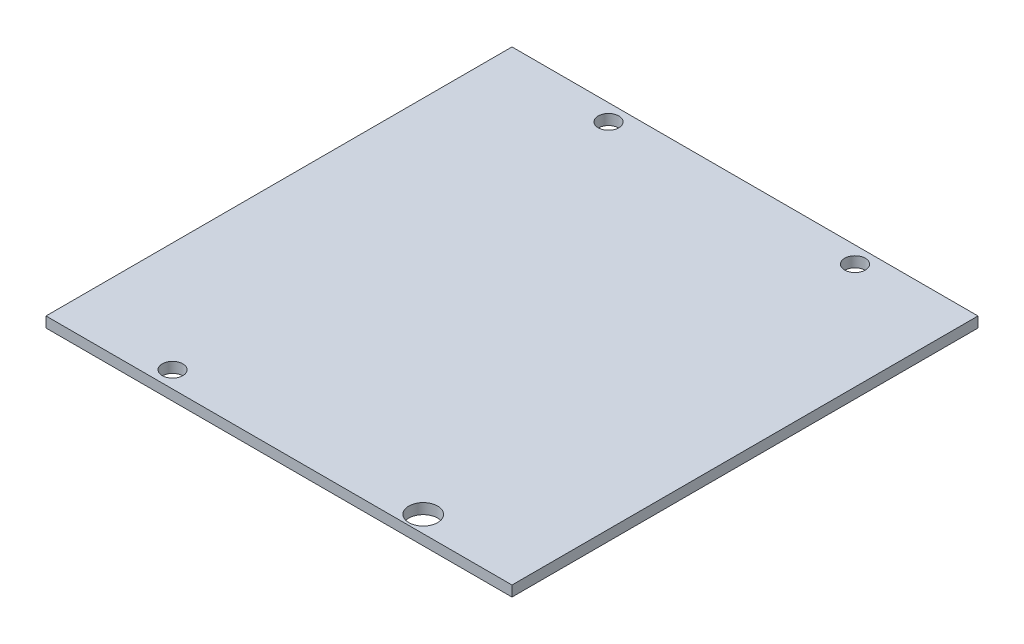
ISO-10303-21;
HEADER;
FILE_DESCRIPTION(('STEP AP214'),'2;1');
FILE_NAME('part.step','',(''),(''),'','','');
FILE_SCHEMA(('AUTOMOTIVE_DESIGN { 1 0 10303 214 1 1 1 1 }'));
ENDSEC;
DATA;
#1=APPLICATION_CONTEXT('core data for automotive mechanical design processes');
#2=APPLICATION_PROTOCOL_DEFINITION('international standard','automotive_design',2000,#1);
#3=PRODUCT_CONTEXT('',#1,'mechanical');
#4=PRODUCT('Part','Part','',(#3));
#5=PRODUCT_RELATED_PRODUCT_CATEGORY('part','',(#4));
#6=PRODUCT_DEFINITION_FORMATION('','',#4);
#7=PRODUCT_DEFINITION_CONTEXT('part definition',#1,'design');
#8=PRODUCT_DEFINITION('design','',#6,#7);
#9=PRODUCT_DEFINITION_SHAPE('','',#8);
#10=(LENGTH_UNIT() NAMED_UNIT(*) SI_UNIT(.MILLI.,.METRE.));
#11=(NAMED_UNIT(*) PLANE_ANGLE_UNIT() SI_UNIT($,.RADIAN.));
#12=(NAMED_UNIT(*) SI_UNIT($,.STERADIAN.) SOLID_ANGLE_UNIT());
#13=UNCERTAINTY_MEASURE_WITH_UNIT(LENGTH_MEASURE(1.E-05),#10,'distance_accuracy_value','');
#14=(GEOMETRIC_REPRESENTATION_CONTEXT(3) GLOBAL_UNCERTAINTY_ASSIGNED_CONTEXT((#13)) GLOBAL_UNIT_ASSIGNED_CONTEXT((#10,
#11,#12)) REPRESENTATION_CONTEXT('',''));
#15=CARTESIAN_POINT('',(0.,0.,0.));
#16=DIRECTION('',(0.,0.,1.));
#17=DIRECTION('',(1.,0.,0.));
#18=AXIS2_PLACEMENT_3D('',#15,#16,#17);
#19=CARTESIAN_POINT('',(0.,2.,0.));
#20=DIRECTION('',(1.,0.,0.));
#21=DIRECTION('',(0.,0.,-1.));
#22=AXIS2_PLACEMENT_3D('',#19,#20,#21);
#23=PLANE('',#22);
#24=DIRECTION('',(0.,0.,1.));
#25=VECTOR('',#24,1.);
#26=CARTESIAN_POINT('',(0.,0.,0.));
#27=LINE('',#26,#25);
#28=CARTESIAN_POINT('',(0.,0.,0.));
#29=VERTEX_POINT('',#28);
#30=CARTESIAN_POINT('',(0.,0.,88.9));
#31=VERTEX_POINT('',#30);
#32=EDGE_CURVE('E96',#29,#31,#27,.T.);
#33=ORIENTED_EDGE('',*,*,#32,.T.);
#34=DIRECTION('',(0.,-1.,0.));
#35=VECTOR('',#34,1.);
#36=CARTESIAN_POINT('',(0.,2.,88.9));
#37=LINE('',#36,#35);
#38=CARTESIAN_POINT('',(0.,2.,88.9));
#39=VERTEX_POINT('',#38);
#40=EDGE_CURVE('E11',#39,#31,#37,.T.);
#41=ORIENTED_EDGE('',*,*,#40,.F.);
#42=DIRECTION('',(0.,0.,1.));
#43=VECTOR('',#42,1.);
#44=CARTESIAN_POINT('',(0.,2.,0.));
#45=LINE('',#44,#43);
#46=CARTESIAN_POINT('',(0.,2.,0.));
#47=VERTEX_POINT('',#46);
#48=EDGE_CURVE('E84',#47,#39,#45,.T.);
#49=ORIENTED_EDGE('',*,*,#48,.F.);
#50=DIRECTION('',(0.,-1.,0.));
#51=VECTOR('',#50,1.);
#52=CARTESIAN_POINT('',(0.,2.,0.));
#53=LINE('',#52,#51);
#54=EDGE_CURVE('E92',#47,#29,#53,.T.);
#55=ORIENTED_EDGE('',*,*,#54,.T.);
#56=EDGE_LOOP('',(#33,#41,#49,#55));
#57=FACE_BOUND('',#56,.T.);
#58=ADVANCED_FACE('F33',(#57),#23,.F.);
#59=CARTESIAN_POINT('',(0.,2.,88.9));
#60=DIRECTION('',(0.,0.,-1.));
#61=DIRECTION('',(-1.,0.,0.));
#62=AXIS2_PLACEMENT_3D('',#59,#60,#61);
#63=PLANE('',#62);
#64=DIRECTION('',(1.,0.,0.));
#65=VECTOR('',#64,1.);
#66=CARTESIAN_POINT('',(0.,0.,88.9));
#67=LINE('',#66,#65);
#68=CARTESIAN_POINT('',(88.9,0.,88.9));
#69=VERTEX_POINT('',#68);
#70=EDGE_CURVE('E88',#31,#69,#67,.T.);
#71=ORIENTED_EDGE('',*,*,#70,.T.);
#72=DIRECTION('',(0.,-1.,0.));
#73=VECTOR('',#72,1.);
#74=CARTESIAN_POINT('',(88.9,2.,88.9));
#75=LINE('',#74,#73);
#76=CARTESIAN_POINT('',(88.9,2.,88.9));
#77=VERTEX_POINT('',#76);
#78=EDGE_CURVE('E41',#77,#69,#75,.T.);
#79=ORIENTED_EDGE('',*,*,#78,.F.);
#80=DIRECTION('',(1.,0.,0.));
#81=VECTOR('',#80,1.);
#82=CARTESIAN_POINT('',(0.,2.,88.9));
#83=LINE('',#82,#81);
#84=EDGE_CURVE('E79',#39,#77,#83,.T.);
#85=ORIENTED_EDGE('',*,*,#84,.F.);
#86=ORIENTED_EDGE('',*,*,#40,.T.);
#87=EDGE_LOOP('',(#71,#79,#85,#86));
#88=FACE_BOUND('',#87,.T.);
#89=ADVANCED_FACE('F87',(#88),#63,.F.);
#90=CARTESIAN_POINT('',(88.9,2.,0.));
#91=DIRECTION('',(-1.,0.,0.));
#92=DIRECTION('',(0.,0.,1.));
#93=AXIS2_PLACEMENT_3D('',#90,#91,#92);
#94=PLANE('',#93);
#95=DIRECTION('',(0.,0.,-1.));
#96=VECTOR('',#95,1.);
#97=CARTESIAN_POINT('',(88.9,0.,0.));
#98=LINE('',#97,#96);
#99=CARTESIAN_POINT('',(88.9,0.,0.));
#100=VERTEX_POINT('',#99);
#101=EDGE_CURVE('E66',#69,#100,#98,.T.);
#102=ORIENTED_EDGE('',*,*,#101,.T.);
#103=DIRECTION('',(0.,-1.,0.));
#104=VECTOR('',#103,1.);
#105=CARTESIAN_POINT('',(88.9,2.,0.));
#106=LINE('',#105,#104);
#107=CARTESIAN_POINT('',(88.9,2.,0.));
#108=VERTEX_POINT('',#107);
#109=EDGE_CURVE('E89',#108,#100,#106,.T.);
#110=ORIENTED_EDGE('',*,*,#109,.F.);
#111=DIRECTION('',(0.,0.,-1.));
#112=VECTOR('',#111,1.);
#113=CARTESIAN_POINT('',(88.9,2.,0.));
#114=LINE('',#113,#112);
#115=EDGE_CURVE('E82',#77,#108,#114,.T.);
#116=ORIENTED_EDGE('',*,*,#115,.F.);
#117=ORIENTED_EDGE('',*,*,#78,.T.);
#118=EDGE_LOOP('',(#102,#110,#116,#117));
#119=FACE_BOUND('',#118,.T.);
#120=ADVANCED_FACE('F90',(#119),#94,.F.);
#121=CARTESIAN_POINT('',(0.,2.,0.));
#122=DIRECTION('',(0.,0.,1.));
#123=DIRECTION('',(1.,0.,0.));
#124=AXIS2_PLACEMENT_3D('',#121,#122,#123);
#125=PLANE('',#124);
#126=DIRECTION('',(-1.,0.,0.));
#127=VECTOR('',#126,1.);
#128=CARTESIAN_POINT('',(0.,0.,0.));
#129=LINE('',#128,#127);
#130=EDGE_CURVE('E72',#100,#29,#129,.T.);
#131=ORIENTED_EDGE('',*,*,#130,.T.);
#132=ORIENTED_EDGE('',*,*,#54,.F.);
#133=DIRECTION('',(-1.,0.,0.));
#134=VECTOR('',#133,1.);
#135=CARTESIAN_POINT('',(0.,2.,0.));
#136=LINE('',#135,#134);
#137=EDGE_CURVE('E49',#108,#47,#136,.T.);
#138=ORIENTED_EDGE('',*,*,#137,.F.);
#139=ORIENTED_EDGE('',*,*,#109,.T.);
#140=EDGE_LOOP('',(#131,#132,#138,#139));
#141=FACE_BOUND('',#140,.T.);
#142=ADVANCED_FACE('F104',(#141),#125,.F.);
#143=CARTESIAN_POINT('',(0.,2.,0.));
#144=DIRECTION('',(0.,1.,0.));
#145=DIRECTION('',(0.,0.,1.));
#146=AXIS2_PLACEMENT_3D('',#143,#144,#145);
#147=PLANE('',#146);
#148=CARTESIAN_POINT('',(20.9557815102719,2.,85.7132552759722));
#149=DIRECTION('',(0.,1.,0.));
#150=DIRECTION('',(0.,0.,1.));
#151=AXIS2_PLACEMENT_3D('',#148,#149,#150);
#152=CIRCLE('',#151,1.96253514326305);
#153=CARTESIAN_POINT('',(20.9557815102719,2.,87.6757904192353));
#154=VERTEX_POINT('',#153);
#155=EDGE_CURVE('E116',#154,#154,#152,.T.);
#156=ORIENTED_EDGE('',*,*,#155,.F.);
#157=EDGE_LOOP('',(#156));
#158=FACE_BOUND('',#157,.T.);
#159=CARTESIAN_POINT('',(68.7555572132422,2.,85.6897658279166));
#160=DIRECTION('',(0.,1.,0.));
#161=DIRECTION('',(0.,0.,1.));
#162=AXIS2_PLACEMENT_3D('',#159,#160,#161);
#163=CIRCLE('',#162,2.7467995247346);
#164=CARTESIAN_POINT('',(68.7555572132422,2.,88.4365653526512));
#165=VERTEX_POINT('',#164);
#166=EDGE_CURVE('E122',#165,#165,#163,.T.);
#167=ORIENTED_EDGE('',*,*,#166,.F.);
#168=EDGE_LOOP('',(#167));
#169=FACE_BOUND('',#168,.T.);
#170=CARTESIAN_POINT('',(68.6103125838012,2.,3.17499999999999));
#171=DIRECTION('',(0.,1.,0.));
#172=DIRECTION('',(0.,0.,1.));
#173=AXIS2_PLACEMENT_3D('',#170,#171,#172);
#174=CIRCLE('',#173,1.96496676567798);
#175=CARTESIAN_POINT('',(68.6103125838012,2.,5.13996676567797));
#176=VERTEX_POINT('',#175);
#177=EDGE_CURVE('E128',#176,#176,#174,.T.);
#178=ORIENTED_EDGE('',*,*,#177,.F.);
#179=EDGE_LOOP('',(#178));
#180=FACE_BOUND('',#179,.T.);
#181=CARTESIAN_POINT('',(21.5923445308157,2.,3.17499999999999));
#182=DIRECTION('',(0.,1.,0.));
#183=DIRECTION('',(0.,0.,1.));
#184=AXIS2_PLACEMENT_3D('',#181,#182,#183);
#185=CIRCLE('',#184,1.96250000000001);
#186=CARTESIAN_POINT('',(21.5923445308157,2.,5.1375));
#187=VERTEX_POINT('',#186);
#188=EDGE_CURVE('E110',#187,#187,#185,.T.);
#189=ORIENTED_EDGE('',*,*,#188,.F.);
#190=EDGE_LOOP('',(#189));
#191=FACE_BOUND('',#190,.T.);
#192=ORIENTED_EDGE('',*,*,#48,.T.);
#193=ORIENTED_EDGE('',*,*,#84,.T.);
#194=ORIENTED_EDGE('',*,*,#115,.T.);
#195=ORIENTED_EDGE('',*,*,#137,.T.);
#196=EDGE_LOOP('',(#192,#193,#194,#195));
#197=FACE_BOUND('',#196,.T.);
#198=ADVANCED_FACE('F80',(#158,#169,#180,#191,#197),#147,.T.);
#199=CARTESIAN_POINT('',(0.,0.,0.));
#200=DIRECTION('',(0.,1.,0.));
#201=DIRECTION('',(0.,0.,1.));
#202=AXIS2_PLACEMENT_3D('',#199,#200,#201);
#203=PLANE('',#202);
#204=CARTESIAN_POINT('',(20.9557815102719,0.,85.7132552759722));
#205=DIRECTION('',(0.,1.,0.));
#206=DIRECTION('',(0.,0.,1.));
#207=AXIS2_PLACEMENT_3D('',#204,#205,#206);
#208=CIRCLE('',#207,1.96253514326305);
#209=CARTESIAN_POINT('',(20.9557815102719,0.,87.6757904192353));
#210=VERTEX_POINT('',#209);
#211=EDGE_CURVE('E119',#210,#210,#208,.T.);
#212=ORIENTED_EDGE('',*,*,#211,.T.);
#213=EDGE_LOOP('',(#212));
#214=FACE_BOUND('',#213,.T.);
#215=CARTESIAN_POINT('',(68.7555572132422,0.,85.6897658279166));
#216=DIRECTION('',(0.,1.,0.));
#217=DIRECTION('',(0.,0.,1.));
#218=AXIS2_PLACEMENT_3D('',#215,#216,#217);
#219=CIRCLE('',#218,2.7467995247346);
#220=CARTESIAN_POINT('',(68.7555572132422,0.,88.4365653526512));
#221=VERTEX_POINT('',#220);
#222=EDGE_CURVE('E125',#221,#221,#219,.T.);
#223=ORIENTED_EDGE('',*,*,#222,.T.);
#224=EDGE_LOOP('',(#223));
#225=FACE_BOUND('',#224,.T.);
#226=CARTESIAN_POINT('',(68.6103125838012,0.,3.17499999999999));
#227=DIRECTION('',(0.,1.,0.));
#228=DIRECTION('',(0.,0.,1.));
#229=AXIS2_PLACEMENT_3D('',#226,#227,#228);
#230=CIRCLE('',#229,1.96496676567798);
#231=CARTESIAN_POINT('',(68.6103125838012,0.,5.13996676567797));
#232=VERTEX_POINT('',#231);
#233=EDGE_CURVE('E113',#232,#232,#230,.T.);
#234=ORIENTED_EDGE('',*,*,#233,.T.);
#235=EDGE_LOOP('',(#234));
#236=FACE_BOUND('',#235,.T.);
#237=CARTESIAN_POINT('',(21.5923445308157,0.,3.17499999999999));
#238=DIRECTION('',(0.,1.,0.));
#239=DIRECTION('',(0.,0.,1.));
#240=AXIS2_PLACEMENT_3D('',#237,#238,#239);
#241=CIRCLE('',#240,1.96250000000001);
#242=CARTESIAN_POINT('',(21.5923445308157,0.,5.1375));
#243=VERTEX_POINT('',#242);
#244=EDGE_CURVE('E99',#243,#243,#241,.T.);
#245=ORIENTED_EDGE('',*,*,#244,.T.);
#246=EDGE_LOOP('',(#245));
#247=FACE_BOUND('',#246,.T.);
#248=ORIENTED_EDGE('',*,*,#32,.F.);
#249=ORIENTED_EDGE('',*,*,#130,.F.);
#250=ORIENTED_EDGE('',*,*,#101,.F.);
#251=ORIENTED_EDGE('',*,*,#70,.F.);
#252=EDGE_LOOP('',(#248,#249,#250,#251));
#253=FACE_BOUND('',#252,.T.);
#254=ADVANCED_FACE('F107',(#214,#225,#236,#247,#253),#203,.F.);
#255=CARTESIAN_POINT('',(21.5923445308157,0.,3.17499999999999));
#256=DIRECTION('',(0.,1.,0.));
#257=DIRECTION('',(0.,0.,1.));
#258=AXIS2_PLACEMENT_3D('',#255,#256,#257);
#259=CYLINDRICAL_SURFACE('',#258,1.96250000000001);
#260=ORIENTED_EDGE('',*,*,#244,.F.);
#261=EDGE_LOOP('',(#260));
#262=FACE_BOUND('',#261,.T.);
#263=ORIENTED_EDGE('',*,*,#188,.T.);
#264=EDGE_LOOP('',(#263));
#265=FACE_BOUND('',#264,.T.);
#266=ADVANCED_FACE('F140',(#262,#265),#259,.F.);
#267=CARTESIAN_POINT('',(68.6103125838012,0.,3.17499999999999));
#268=DIRECTION('',(0.,1.,0.));
#269=DIRECTION('',(0.,0.,1.));
#270=AXIS2_PLACEMENT_3D('',#267,#268,#269);
#271=CYLINDRICAL_SURFACE('',#270,1.96496676567798);
#272=ORIENTED_EDGE('',*,*,#233,.F.);
#273=EDGE_LOOP('',(#272));
#274=FACE_BOUND('',#273,.T.);
#275=ORIENTED_EDGE('',*,*,#177,.T.);
#276=EDGE_LOOP('',(#275));
#277=FACE_BOUND('',#276,.T.);
#278=ADVANCED_FACE('F136',(#274,#277),#271,.F.);
#279=CARTESIAN_POINT('',(68.7555572132422,0.,85.6897658279166));
#280=DIRECTION('',(0.,1.,0.));
#281=DIRECTION('',(0.,0.,1.));
#282=AXIS2_PLACEMENT_3D('',#279,#280,#281);
#283=CYLINDRICAL_SURFACE('',#282,2.7467995247346);
#284=ORIENTED_EDGE('',*,*,#222,.F.);
#285=EDGE_LOOP('',(#284));
#286=FACE_BOUND('',#285,.T.);
#287=ORIENTED_EDGE('',*,*,#166,.T.);
#288=EDGE_LOOP('',(#287));
#289=FACE_BOUND('',#288,.T.);
#290=ADVANCED_FACE('F139',(#286,#289),#283,.F.);
#291=CARTESIAN_POINT('',(20.9557815102719,0.,85.7132552759722));
#292=DIRECTION('',(0.,1.,0.));
#293=DIRECTION('',(0.,0.,1.));
#294=AXIS2_PLACEMENT_3D('',#291,#292,#293);
#295=CYLINDRICAL_SURFACE('',#294,1.96253514326305);
#296=ORIENTED_EDGE('',*,*,#211,.F.);
#297=EDGE_LOOP('',(#296));
#298=FACE_BOUND('',#297,.T.);
#299=ORIENTED_EDGE('',*,*,#155,.T.);
#300=EDGE_LOOP('',(#299));
#301=FACE_BOUND('',#300,.T.);
#302=ADVANCED_FACE('F203',(#298,#301),#295,.F.);
#303=CLOSED_SHELL('',(#58,#89,#120,#142,#198,#254,#266,#278,#290,#302));
#304=MANIFOLD_SOLID_BREP('B2',#303);
#305=ADVANCED_BREP_SHAPE_REPRESENTATION('',(#18,#304),#14);
#306=SHAPE_DEFINITION_REPRESENTATION(#9,#305);
ENDSEC;
END-ISO-10303-21;
